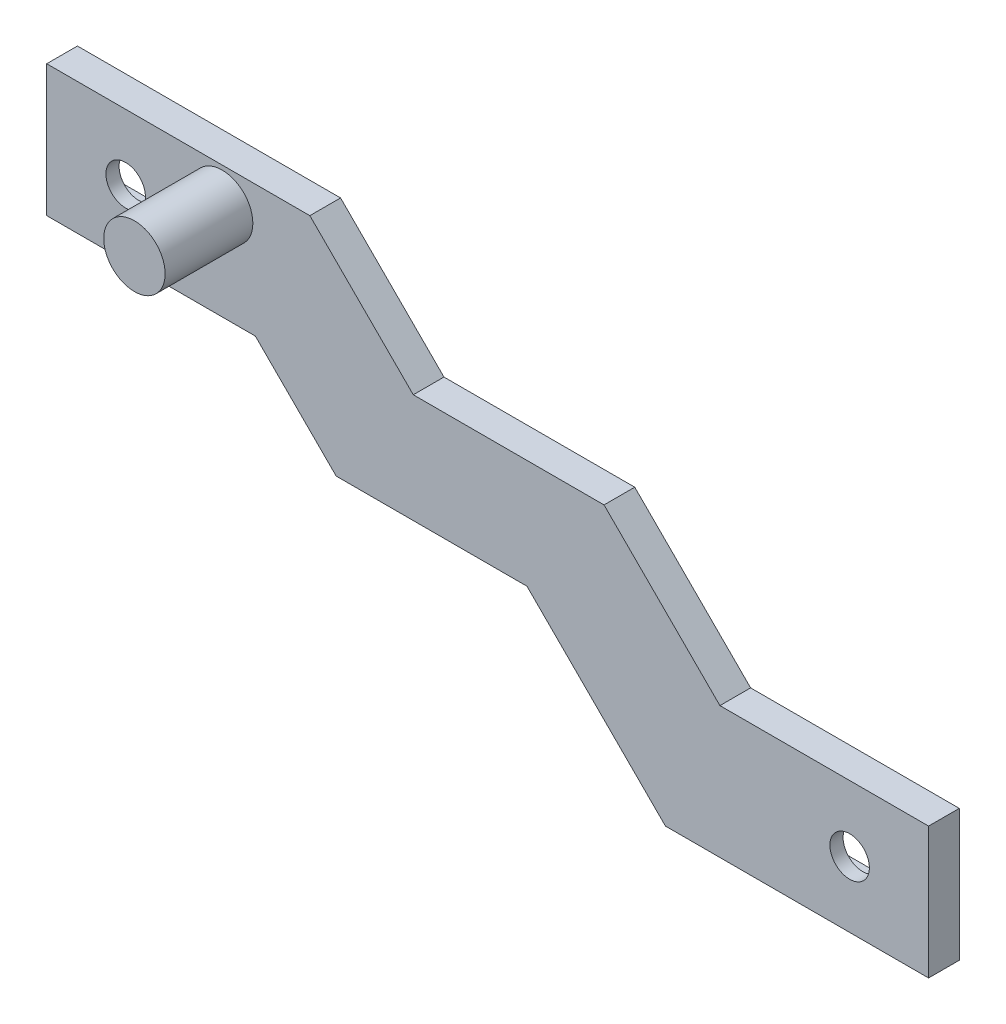
ISO-10303-21;
HEADER;
FILE_DESCRIPTION(('STEP AP214'),'2;1');
FILE_NAME('part.step','',(''),(''),'','','');
FILE_SCHEMA(('AUTOMOTIVE_DESIGN { 1 0 10303 214 1 1 1 1 }'));
ENDSEC;
DATA;
#1=APPLICATION_CONTEXT('core data for automotive mechanical design processes');
#2=APPLICATION_PROTOCOL_DEFINITION('international standard','automotive_design',2000,#1);
#3=PRODUCT_CONTEXT('',#1,'mechanical');
#4=PRODUCT('Part','Part','',(#3));
#5=PRODUCT_RELATED_PRODUCT_CATEGORY('part','',(#4));
#6=PRODUCT_DEFINITION_FORMATION('','',#4);
#7=PRODUCT_DEFINITION_CONTEXT('part definition',#1,'design');
#8=PRODUCT_DEFINITION('design','',#6,#7);
#9=PRODUCT_DEFINITION_SHAPE('','',#8);
#10=(LENGTH_UNIT() NAMED_UNIT(*) SI_UNIT(.MILLI.,.METRE.));
#11=(NAMED_UNIT(*) PLANE_ANGLE_UNIT() SI_UNIT($,.RADIAN.));
#12=(NAMED_UNIT(*) SI_UNIT($,.STERADIAN.) SOLID_ANGLE_UNIT());
#13=UNCERTAINTY_MEASURE_WITH_UNIT(LENGTH_MEASURE(1.E-05),#10,'distance_accuracy_value','');
#14=(GEOMETRIC_REPRESENTATION_CONTEXT(3) GLOBAL_UNCERTAINTY_ASSIGNED_CONTEXT((#13)) GLOBAL_UNIT_ASSIGNED_CONTEXT((#10,
#11,#12)) REPRESENTATION_CONTEXT('',''));
#15=CARTESIAN_POINT('',(0.,0.,0.));
#16=DIRECTION('',(0.,0.,1.));
#17=DIRECTION('',(1.,0.,0.));
#18=AXIS2_PLACEMENT_3D('',#15,#16,#17);
#19=CARTESIAN_POINT('',(0.,0.,0.));
#20=DIRECTION('',(0.,0.,1.));
#21=DIRECTION('',(1.,0.,0.));
#22=AXIS2_PLACEMENT_3D('',#19,#20,#21);
#23=PLANE('',#22);
#24=DIRECTION('',(0.,1.,0.));
#25=VECTOR('',#24,1.);
#26=CARTESIAN_POINT('',(32.7303847577293,21.5,0.));
#27=LINE('',#26,#25);
#28=CARTESIAN_POINT('',(32.7303847577293,21.5,0.));
#29=VERTEX_POINT('',#28);
#30=CARTESIAN_POINT('',(32.7303847577293,28.5,0.));
#31=VERTEX_POINT('',#30);
#32=EDGE_CURVE('E307',#29,#31,#27,.T.);
#33=ORIENTED_EDGE('',*,*,#32,.T.);
#34=DIRECTION('',(-1.,0.,0.));
#35=VECTOR('',#34,1.);
#36=CARTESIAN_POINT('',(32.7303847577293,28.5,0.));
#37=LINE('',#36,#35);
#38=CARTESIAN_POINT('',(15.7303847577293,28.5,0.));
#39=VERTEX_POINT('',#38);
#40=EDGE_CURVE('E324',#31,#39,#37,.T.);
#41=ORIENTED_EDGE('',*,*,#40,.T.);
#42=DIRECTION('',(0.,-1.,0.));
#43=VECTOR('',#42,1.);
#44=CARTESIAN_POINT('',(15.7303847577293,21.5,0.));
#45=LINE('',#44,#43);
#46=CARTESIAN_POINT('',(15.7303847577293,21.5,0.));
#47=VERTEX_POINT('',#46);
#48=EDGE_CURVE('E327',#39,#47,#45,.T.);
#49=ORIENTED_EDGE('',*,*,#48,.T.);
#50=DIRECTION('',(1.,0.,0.));
#51=VECTOR('',#50,1.);
#52=CARTESIAN_POINT('',(32.7303847577293,21.5,0.));
#53=LINE('',#52,#51);
#54=EDGE_CURVE('E312',#47,#29,#53,.T.);
#55=ORIENTED_EDGE('',*,*,#54,.T.);
#56=EDGE_LOOP('',(#33,#41,#49,#55));
#57=FACE_BOUND('',#56,.T.);
#58=DIRECTION('',(0.,1.,0.));
#59=VECTOR('',#58,1.);
#60=CARTESIAN_POINT('',(109.269615242271,-3.49999999999999,0.));
#61=LINE('',#60,#59);
#62=CARTESIAN_POINT('',(109.269615242271,-3.49999999999999,0.));
#63=VERTEX_POINT('',#62);
#64=CARTESIAN_POINT('',(109.269615242271,3.5,0.));
#65=VERTEX_POINT('',#64);
#66=EDGE_CURVE('E273',#63,#65,#61,.T.);
#67=ORIENTED_EDGE('',*,*,#66,.T.);
#68=DIRECTION('',(-1.,0.,0.));
#69=VECTOR('',#68,1.);
#70=CARTESIAN_POINT('',(109.269615242271,3.5,0.));
#71=LINE('',#70,#69);
#72=CARTESIAN_POINT('',(92.2696152422706,3.5,0.));
#73=VERTEX_POINT('',#72);
#74=EDGE_CURVE('E290',#65,#73,#71,.T.);
#75=ORIENTED_EDGE('',*,*,#74,.T.);
#76=DIRECTION('',(0.,-1.,0.));
#77=VECTOR('',#76,1.);
#78=CARTESIAN_POINT('',(92.2696152422706,-3.5,0.));
#79=LINE('',#78,#77);
#80=CARTESIAN_POINT('',(92.2696152422706,-3.5,0.));
#81=VERTEX_POINT('',#80);
#82=EDGE_CURVE('E293',#73,#81,#79,.T.);
#83=ORIENTED_EDGE('',*,*,#82,.T.);
#84=DIRECTION('',(1.,0.,0.));
#85=VECTOR('',#84,1.);
#86=CARTESIAN_POINT('',(109.269615242271,-3.49999999999999,0.));
#87=LINE('',#86,#85);
#88=EDGE_CURVE('E278',#81,#63,#87,.T.);
#89=ORIENTED_EDGE('',*,*,#88,.T.);
#90=EDGE_LOOP('',(#67,#75,#83,#89));
#91=FACE_BOUND('',#90,.T.);
#92=DIRECTION('',(-0.707106781186552,0.707106781186543,0.));
#93=VECTOR('',#92,1.);
#94=CARTESIAN_POINT('',(37.3651923788644,37.3651923788649,0.));
#95=LINE('',#94,#93);
#96=CARTESIAN_POINT('',(54.0203847577294,20.7100000000001,0.));
#97=VERTEX_POINT('',#96);
#98=CARTESIAN_POINT('',(42.2303847577293,32.5,0.));
#99=VERTEX_POINT('',#98);
#100=EDGE_CURVE('E250',#97,#99,#95,.T.);
#101=ORIENTED_EDGE('',*,*,#100,.F.);
#102=DIRECTION('',(-1.,0.,0.));
#103=VECTOR('',#102,1.);
#104=CARTESIAN_POINT('',(0.,20.7100000000001,0.));
#105=LINE('',#104,#103);
#106=CARTESIAN_POINT('',(75.7696152422707,20.7100000000001,0.));
#107=VERTEX_POINT('',#106);
#108=EDGE_CURVE('E248',#107,#97,#105,.T.);
#109=ORIENTED_EDGE('',*,*,#108,.F.);
#110=DIRECTION('',(-0.707106781186546,0.707106781186549,0.));
#111=VECTOR('',#110,1.);
#112=CARTESIAN_POINT('',(48.2398076211355,48.2398076211353,0.));
#113=LINE('',#112,#111);
#114=CARTESIAN_POINT('',(88.9796152422707,7.50000000000003,0.));
#115=VERTEX_POINT('',#114);
#116=EDGE_CURVE('E246',#115,#107,#113,.T.);
#117=ORIENTED_EDGE('',*,*,#116,.F.);
#118=DIRECTION('',(-1.,0.,0.));
#119=VECTOR('',#118,1.);
#120=CARTESIAN_POINT('',(0.,7.50000000000003,0.));
#121=LINE('',#120,#119);
#122=CARTESIAN_POINT('',(112.769615242271,7.50000000000003,0.));
#123=VERTEX_POINT('',#122);
#124=EDGE_CURVE('E244',#123,#115,#121,.T.);
#125=ORIENTED_EDGE('',*,*,#124,.F.);
#126=DIRECTION('',(0.,1.,0.));
#127=VECTOR('',#126,1.);
#128=CARTESIAN_POINT('',(112.769615242271,-7.49999999999999,0.));
#129=LINE('',#128,#127);
#130=CARTESIAN_POINT('',(112.769615242271,-7.49999999999999,0.));
#131=VERTEX_POINT('',#130);
#132=EDGE_CURVE('E341',#131,#123,#129,.T.);
#133=ORIENTED_EDGE('',*,*,#132,.F.);
#134=DIRECTION('',(1.,0.,0.));
#135=VECTOR('',#134,1.);
#136=CARTESIAN_POINT('',(112.769615242271,-7.49999999999999,0.));
#137=LINE('',#136,#135);
#138=CARTESIAN_POINT('',(82.7696152422706,-7.5,0.));
#139=VERTEX_POINT('',#138);
#140=EDGE_CURVE('E349',#139,#131,#137,.T.);
#141=ORIENTED_EDGE('',*,*,#140,.F.);
#142=DIRECTION('',(0.707106781186552,-0.707106781186543,0.));
#143=VECTOR('',#142,1.);
#144=CARTESIAN_POINT('',(37.6348076211348,37.6348076211353,0.));
#145=LINE('',#144,#143);
#146=CARTESIAN_POINT('',(66.9828186778667,8.28679656440374,0.));
#147=VERTEX_POINT('',#146);
#148=EDGE_CURVE('E242',#147,#139,#145,.T.);
#149=ORIENTED_EDGE('',*,*,#148,.F.);
#150=DIRECTION('',(1.,0.,0.));
#151=VECTOR('',#150,1.);
#152=CARTESIAN_POINT('',(0.,8.28679656440372,0.));
#153=LINE('',#152,#151);
#154=CARTESIAN_POINT('',(45.2303847577293,8.28679656440373,0.));
#155=VERTEX_POINT('',#154);
#156=EDGE_CURVE('E240',#155,#147,#153,.T.);
#157=ORIENTED_EDGE('',*,*,#156,.F.);
#158=DIRECTION('',(0.707106781186552,-0.707106781186543,0.));
#159=VECTOR('',#158,1.);
#160=CARTESIAN_POINT('',(26.7585906610663,26.7585906610666,0.));
#161=LINE('',#160,#159);
#162=CARTESIAN_POINT('',(36.0171813221329,17.5,0.));
#163=VERTEX_POINT('',#162);
#164=EDGE_CURVE('E184',#163,#155,#161,.T.);
#165=ORIENTED_EDGE('',*,*,#164,.F.);
#166=DIRECTION('',(1.,0.,0.));
#167=VECTOR('',#166,1.);
#168=CARTESIAN_POINT('',(0.,17.5,0.));
#169=LINE('',#168,#167);
#170=CARTESIAN_POINT('',(12.2303847577293,17.5,0.));
#171=VERTEX_POINT('',#170);
#172=EDGE_CURVE('E222',#171,#163,#169,.T.);
#173=ORIENTED_EDGE('',*,*,#172,.F.);
#174=DIRECTION('',(0.,-1.,0.));
#175=VECTOR('',#174,1.);
#176=CARTESIAN_POINT('',(12.2303847577293,-7.50000000000001,0.));
#177=LINE('',#176,#175);
#178=CARTESIAN_POINT('',(12.2303847577293,32.5,0.));
#179=VERTEX_POINT('',#178);
#180=EDGE_CURVE('E346',#179,#171,#177,.T.);
#181=ORIENTED_EDGE('',*,*,#180,.F.);
#182=DIRECTION('',(-1.,0.,0.));
#183=VECTOR('',#182,1.);
#184=CARTESIAN_POINT('',(112.769615242271,32.5,0.));
#185=LINE('',#184,#183);
#186=EDGE_CURVE('E344',#99,#179,#185,.T.);
#187=ORIENTED_EDGE('',*,*,#186,.F.);
#188=EDGE_LOOP('',(#101,#109,#117,#125,#133,#141,#149,#157,#165,#173,#181,#187));
#189=FACE_BOUND('',#188,.T.);
#190=ADVANCED_FACE('F43',(#57,#91,#189),#23,.F.);
#191=CARTESIAN_POINT('',(112.769615242271,-7.49999999999999,2.));
#192=DIRECTION('',(-1.,0.,0.));
#193=DIRECTION('',(0.,0.,1.));
#194=AXIS2_PLACEMENT_3D('',#191,#192,#193);
#195=PLANE('',#194);
#196=DIRECTION('',(0.,0.,1.));
#197=VECTOR('',#196,1.);
#198=CARTESIAN_POINT('',(112.769615242271,7.50000000000003,-28.));
#199=LINE('',#198,#197);
#200=CARTESIAN_POINT('',(112.769615242271,7.50000000000003,3.5));
#201=VERTEX_POINT('',#200);
#202=EDGE_CURVE('E229',#123,#201,#199,.T.);
#203=ORIENTED_EDGE('',*,*,#202,.T.);
#204=DIRECTION('',(0.,1.,0.));
#205=VECTOR('',#204,1.);
#206=CARTESIAN_POINT('',(112.769615242271,32.5,3.5));
#207=LINE('',#206,#205);
#208=CARTESIAN_POINT('',(112.769615242271,-7.49999999999999,3.5));
#209=VERTEX_POINT('',#208);
#210=EDGE_CURVE('E268',#209,#201,#207,.T.);
#211=ORIENTED_EDGE('',*,*,#210,.F.);
#212=DIRECTION('',(0.,0.,-1.));
#213=VECTOR('',#212,1.);
#214=CARTESIAN_POINT('',(112.769615242271,-7.49999999999999,2.));
#215=LINE('',#214,#213);
#216=EDGE_CURVE('E51',#209,#131,#215,.T.);
#217=ORIENTED_EDGE('',*,*,#216,.T.);
#218=ORIENTED_EDGE('',*,*,#132,.T.);
#219=EDGE_LOOP('',(#203,#211,#217,#218));
#220=FACE_BOUND('',#219,.T.);
#221=ADVANCED_FACE('F45',(#220),#195,.F.);
#222=CARTESIAN_POINT('',(112.769615242271,32.5,2.));
#223=DIRECTION('',(0.,-1.,0.));
#224=DIRECTION('',(1.,0.,0.));
#225=AXIS2_PLACEMENT_3D('',#222,#223,#224);
#226=PLANE('',#225);
#227=DIRECTION('',(0.,0.,1.));
#228=VECTOR('',#227,1.);
#229=CARTESIAN_POINT('',(42.2303847577293,32.5,-28.));
#230=LINE('',#229,#228);
#231=CARTESIAN_POINT('',(42.2303847577293,32.5,3.5));
#232=VERTEX_POINT('',#231);
#233=EDGE_CURVE('E220',#99,#232,#230,.T.);
#234=ORIENTED_EDGE('',*,*,#233,.F.);
#235=ORIENTED_EDGE('',*,*,#186,.T.);
#236=DIRECTION('',(0.,0.,-1.));
#237=VECTOR('',#236,1.);
#238=CARTESIAN_POINT('',(12.2303847577293,32.5,2.));
#239=LINE('',#238,#237);
#240=CARTESIAN_POINT('',(12.2303847577293,32.5,3.5));
#241=VERTEX_POINT('',#240);
#242=EDGE_CURVE('E11',#241,#179,#239,.T.);
#243=ORIENTED_EDGE('',*,*,#242,.F.);
#244=DIRECTION('',(-1.,0.,0.));
#245=VECTOR('',#244,1.);
#246=CARTESIAN_POINT('',(12.2303847577293,32.5,3.5));
#247=LINE('',#246,#245);
#248=EDGE_CURVE('E271',#232,#241,#247,.T.);
#249=ORIENTED_EDGE('',*,*,#248,.F.);
#250=EDGE_LOOP('',(#234,#235,#243,#249));
#251=FACE_BOUND('',#250,.T.);
#252=ADVANCED_FACE('F380',(#251),#226,.F.);
#253=CARTESIAN_POINT('',(12.2303847577293,-7.50000000000001,2.));
#254=DIRECTION('',(1.,0.,0.));
#255=DIRECTION('',(0.,0.,-1.));
#256=AXIS2_PLACEMENT_3D('',#253,#254,#255);
#257=PLANE('',#256);
#258=DIRECTION('',(0.,0.,1.));
#259=VECTOR('',#258,1.);
#260=CARTESIAN_POINT('',(12.2303847577293,17.5,-28.));
#261=LINE('',#260,#259);
#262=CARTESIAN_POINT('',(12.2303847577293,17.5,3.5));
#263=VERTEX_POINT('',#262);
#264=EDGE_CURVE('E219',#171,#263,#261,.T.);
#265=ORIENTED_EDGE('',*,*,#264,.T.);
#266=DIRECTION('',(0.,-1.,0.));
#267=VECTOR('',#266,1.);
#268=CARTESIAN_POINT('',(12.2303847577293,32.5,3.5));
#269=LINE('',#268,#267);
#270=EDGE_CURVE('E262',#241,#263,#269,.T.);
#271=ORIENTED_EDGE('',*,*,#270,.F.);
#272=ORIENTED_EDGE('',*,*,#242,.T.);
#273=ORIENTED_EDGE('',*,*,#180,.T.);
#274=EDGE_LOOP('',(#265,#271,#272,#273));
#275=FACE_BOUND('',#274,.T.);
#276=ADVANCED_FACE('F390',(#275),#257,.F.);
#277=CARTESIAN_POINT('',(112.769615242271,-7.49999999999999,2.));
#278=DIRECTION('',(0.,1.,0.));
#279=DIRECTION('',(-1.,0.,0.));
#280=AXIS2_PLACEMENT_3D('',#277,#278,#279);
#281=PLANE('',#280);
#282=DIRECTION('',(0.,0.,1.));
#283=VECTOR('',#282,1.);
#284=CARTESIAN_POINT('',(82.7696152422706,-7.5,-28.));
#285=LINE('',#284,#283);
#286=CARTESIAN_POINT('',(82.7696152422706,-7.5,3.5));
#287=VERTEX_POINT('',#286);
#288=EDGE_CURVE('E232',#139,#287,#285,.T.);
#289=ORIENTED_EDGE('',*,*,#288,.F.);
#290=ORIENTED_EDGE('',*,*,#140,.T.);
#291=ORIENTED_EDGE('',*,*,#216,.F.);
#292=DIRECTION('',(1.,0.,0.));
#293=VECTOR('',#292,1.);
#294=CARTESIAN_POINT('',(12.2303847577293,-7.49999999999999,3.5));
#295=LINE('',#294,#293);
#296=EDGE_CURVE('E266',#287,#209,#295,.T.);
#297=ORIENTED_EDGE('',*,*,#296,.F.);
#298=EDGE_LOOP('',(#289,#290,#291,#297));
#299=FACE_BOUND('',#298,.T.);
#300=ADVANCED_FACE('F384',(#299),#281,.F.);
#301=CARTESIAN_POINT('',(0.,0.,3.5));
#302=DIRECTION('',(0.,0.,1.));
#303=DIRECTION('',(1.,0.,0.));
#304=AXIS2_PLACEMENT_3D('',#301,#302,#303);
#305=PLANE('',#304);
#306=CARTESIAN_POINT('',(32.2303847577293,28.5,3.5));
#307=DIRECTION('',(0.,0.,1.));
#308=DIRECTION('',(1.,0.,0.));
#309=AXIS2_PLACEMENT_3D('',#306,#307,#308);
#310=CIRCLE('',#309,3.5);
#311=CARTESIAN_POINT('',(35.7303847577293,28.5,3.5));
#312=VERTEX_POINT('',#311);
#313=EDGE_CURVE('E680',#312,#312,#310,.T.);
#314=ORIENTED_EDGE('',*,*,#313,.F.);
#315=EDGE_LOOP('',(#314));
#316=FACE_BOUND('',#315,.T.);
#317=CARTESIAN_POINT('',(21.2303847577281,25.,3.5));
#318=DIRECTION('',(0.,0.,1.));
#319=DIRECTION('',(1.,0.,0.));
#320=AXIS2_PLACEMENT_3D('',#317,#318,#319);
#321=CIRCLE('',#320,2.25);
#322=CARTESIAN_POINT('',(23.4803847577281,25.,3.5));
#323=VERTEX_POINT('',#322);
#324=EDGE_CURVE('E259',#323,#323,#321,.T.);
#325=ORIENTED_EDGE('',*,*,#324,.F.);
#326=EDGE_LOOP('',(#325));
#327=FACE_BOUND('',#326,.T.);
#328=CARTESIAN_POINT('',(103.769615242269,3.67761376907083E-13,3.5));
#329=DIRECTION('',(0.,0.,1.));
#330=DIRECTION('',(1.,0.,0.));
#331=AXIS2_PLACEMENT_3D('',#328,#329,#330);
#332=CIRCLE('',#331,2.25);
#333=CARTESIAN_POINT('',(106.019615242269,3.67761376907083E-13,3.5));
#334=VERTEX_POINT('',#333);
#335=EDGE_CURVE('E253',#334,#334,#332,.T.);
#336=ORIENTED_EDGE('',*,*,#335,.F.);
#337=EDGE_LOOP('',(#336));
#338=FACE_BOUND('',#337,.T.);
#339=DIRECTION('',(-1.,0.,0.));
#340=VECTOR('',#339,1.);
#341=CARTESIAN_POINT('',(54.0203847577294,20.7100000000001,3.5));
#342=LINE('',#341,#340);
#343=CARTESIAN_POINT('',(75.7696152422707,20.7100000000001,3.5));
#344=VERTEX_POINT('',#343);
#345=CARTESIAN_POINT('',(54.0203847577294,20.7100000000001,3.5));
#346=VERTEX_POINT('',#345);
#347=EDGE_CURVE('E214',#344,#346,#342,.T.);
#348=ORIENTED_EDGE('',*,*,#347,.T.);
#349=DIRECTION('',(-0.707106781186552,0.707106781186543,0.));
#350=VECTOR('',#349,1.);
#351=CARTESIAN_POINT('',(42.2303847577293,32.5,3.5));
#352=LINE('',#351,#350);
#353=EDGE_CURVE('E216',#346,#232,#352,.T.);
#354=ORIENTED_EDGE('',*,*,#353,.T.);
#355=ORIENTED_EDGE('',*,*,#248,.T.);
#356=ORIENTED_EDGE('',*,*,#270,.T.);
#357=DIRECTION('',(1.,0.,0.));
#358=VECTOR('',#357,1.);
#359=CARTESIAN_POINT('',(36.0171813221329,17.5,3.5));
#360=LINE('',#359,#358);
#361=CARTESIAN_POINT('',(36.0171813221329,17.5,3.5));
#362=VERTEX_POINT('',#361);
#363=EDGE_CURVE('E203',#263,#362,#360,.T.);
#364=ORIENTED_EDGE('',*,*,#363,.T.);
#365=DIRECTION('',(0.707106781186552,-0.707106781186543,0.));
#366=VECTOR('',#365,1.);
#367=CARTESIAN_POINT('',(45.2303847577293,8.28679656440373,3.5));
#368=LINE('',#367,#366);
#369=CARTESIAN_POINT('',(45.2303847577293,8.28679656440373,3.5));
#370=VERTEX_POINT('',#369);
#371=EDGE_CURVE('E66',#362,#370,#368,.T.);
#372=ORIENTED_EDGE('',*,*,#371,.T.);
#373=DIRECTION('',(1.,0.,0.));
#374=VECTOR('',#373,1.);
#375=CARTESIAN_POINT('',(66.9828186778667,8.28679656440374,3.5));
#376=LINE('',#375,#374);
#377=CARTESIAN_POINT('',(66.9828186778667,8.28679656440374,3.5));
#378=VERTEX_POINT('',#377);
#379=EDGE_CURVE('E191',#370,#378,#376,.T.);
#380=ORIENTED_EDGE('',*,*,#379,.T.);
#381=DIRECTION('',(0.707106781186552,-0.707106781186543,0.));
#382=VECTOR('',#381,1.);
#383=CARTESIAN_POINT('',(82.7696152422706,-7.5,3.5));
#384=LINE('',#383,#382);
#385=EDGE_CURVE('E197',#378,#287,#384,.T.);
#386=ORIENTED_EDGE('',*,*,#385,.T.);
#387=ORIENTED_EDGE('',*,*,#296,.T.);
#388=ORIENTED_EDGE('',*,*,#210,.T.);
#389=DIRECTION('',(-1.,0.,0.));
#390=VECTOR('',#389,1.);
#391=CARTESIAN_POINT('',(88.9796152422707,7.50000000000003,3.5));
#392=LINE('',#391,#390);
#393=CARTESIAN_POINT('',(88.9796152422707,7.50000000000003,3.5));
#394=VERTEX_POINT('',#393);
#395=EDGE_CURVE('E210',#201,#394,#392,.T.);
#396=ORIENTED_EDGE('',*,*,#395,.T.);
#397=DIRECTION('',(-0.707106781186546,0.707106781186549,0.));
#398=VECTOR('',#397,1.);
#399=CARTESIAN_POINT('',(75.7696152422707,20.7100000000001,3.5));
#400=LINE('',#399,#398);
#401=EDGE_CURVE('E58',#394,#344,#400,.T.);
#402=ORIENTED_EDGE('',*,*,#401,.T.);
#403=EDGE_LOOP('',(#348,#354,#355,#356,#364,#372,#380,#386,#387,#388,#396,#402));
#404=FACE_BOUND('',#403,.T.);
#405=ADVANCED_FACE('F201',(#316,#327,#338,#404),#305,.T.);
#406=CARTESIAN_POINT('',(32.7303847577293,21.5,2.));
#407=DIRECTION('',(-1.,0.,0.));
#408=DIRECTION('',(0.,0.,1.));
#409=AXIS2_PLACEMENT_3D('',#406,#407,#408);
#410=PLANE('',#409);
#411=ORIENTED_EDGE('',*,*,#32,.F.);
#412=DIRECTION('',(0.,0.,-1.));
#413=VECTOR('',#412,1.);
#414=CARTESIAN_POINT('',(32.7303847577293,21.5,2.));
#415=LINE('',#414,#413);
#416=CARTESIAN_POINT('',(32.7303847577293,21.5,2.));
#417=VERTEX_POINT('',#416);
#418=EDGE_CURVE('E321',#417,#29,#415,.T.);
#419=ORIENTED_EDGE('',*,*,#418,.F.);
#420=DIRECTION('',(0.,1.,0.));
#421=VECTOR('',#420,1.);
#422=CARTESIAN_POINT('',(32.7303847577293,21.5,2.));
#423=LINE('',#422,#421);
#424=CARTESIAN_POINT('',(32.7303847577293,28.5,2.));
#425=VERTEX_POINT('',#424);
#426=EDGE_CURVE('E308',#417,#425,#423,.T.);
#427=ORIENTED_EDGE('',*,*,#426,.T.);
#428=DIRECTION('',(0.,0.,-1.));
#429=VECTOR('',#428,1.);
#430=CARTESIAN_POINT('',(32.7303847577293,28.5,2.));
#431=LINE('',#430,#429);
#432=EDGE_CURVE('E338',#425,#31,#431,.T.);
#433=ORIENTED_EDGE('',*,*,#432,.T.);
#434=EDGE_LOOP('',(#411,#419,#427,#433));
#435=FACE_BOUND('',#434,.T.);
#436=ADVANCED_FACE('F413',(#435),#410,.T.);
#437=CARTESIAN_POINT('',(32.7303847577293,28.5,2.));
#438=DIRECTION('',(0.,-1.,0.));
#439=DIRECTION('',(0.,0.,-1.));
#440=AXIS2_PLACEMENT_3D('',#437,#438,#439);
#441=PLANE('',#440);
#442=ORIENTED_EDGE('',*,*,#40,.F.);
#443=ORIENTED_EDGE('',*,*,#432,.F.);
#444=DIRECTION('',(-1.,0.,0.));
#445=VECTOR('',#444,1.);
#446=CARTESIAN_POINT('',(32.7303847577293,28.5,2.));
#447=LINE('',#446,#445);
#448=CARTESIAN_POINT('',(15.7303847577293,28.5,2.));
#449=VERTEX_POINT('',#448);
#450=EDGE_CURVE('E311',#425,#449,#447,.T.);
#451=ORIENTED_EDGE('',*,*,#450,.T.);
#452=DIRECTION('',(0.,0.,-1.));
#453=VECTOR('',#452,1.);
#454=CARTESIAN_POINT('',(15.7303847577293,28.5,2.));
#455=LINE('',#454,#453);
#456=EDGE_CURVE('E336',#449,#39,#455,.T.);
#457=ORIENTED_EDGE('',*,*,#456,.T.);
#458=EDGE_LOOP('',(#442,#443,#451,#457));
#459=FACE_BOUND('',#458,.T.);
#460=ADVANCED_FACE('F525',(#459),#441,.T.);
#461=CARTESIAN_POINT('',(15.7303847577293,21.5,2.));
#462=DIRECTION('',(1.,0.,0.));
#463=DIRECTION('',(0.,0.,-1.));
#464=AXIS2_PLACEMENT_3D('',#461,#462,#463);
#465=PLANE('',#464);
#466=ORIENTED_EDGE('',*,*,#48,.F.);
#467=ORIENTED_EDGE('',*,*,#456,.F.);
#468=DIRECTION('',(0.,-1.,0.));
#469=VECTOR('',#468,1.);
#470=CARTESIAN_POINT('',(15.7303847577293,21.5,2.));
#471=LINE('',#470,#469);
#472=CARTESIAN_POINT('',(15.7303847577293,21.5,2.));
#473=VERTEX_POINT('',#472);
#474=EDGE_CURVE('E315',#449,#473,#471,.T.);
#475=ORIENTED_EDGE('',*,*,#474,.T.);
#476=DIRECTION('',(0.,0.,-1.));
#477=VECTOR('',#476,1.);
#478=CARTESIAN_POINT('',(15.7303847577293,21.5,2.));
#479=LINE('',#478,#477);
#480=EDGE_CURVE('E334',#473,#47,#479,.T.);
#481=ORIENTED_EDGE('',*,*,#480,.T.);
#482=EDGE_LOOP('',(#466,#467,#475,#481));
#483=FACE_BOUND('',#482,.T.);
#484=ADVANCED_FACE('F516',(#483),#465,.T.);
#485=CARTESIAN_POINT('',(32.7303847577293,21.5,2.));
#486=DIRECTION('',(0.,1.,0.));
#487=DIRECTION('',(-1.,0.,0.));
#488=AXIS2_PLACEMENT_3D('',#485,#486,#487);
#489=PLANE('',#488);
#490=ORIENTED_EDGE('',*,*,#54,.F.);
#491=ORIENTED_EDGE('',*,*,#480,.F.);
#492=DIRECTION('',(1.,0.,0.));
#493=VECTOR('',#492,1.);
#494=CARTESIAN_POINT('',(32.7303847577293,21.5,2.));
#495=LINE('',#494,#493);
#496=EDGE_CURVE('E318',#473,#417,#495,.T.);
#497=ORIENTED_EDGE('',*,*,#496,.T.);
#498=ORIENTED_EDGE('',*,*,#418,.T.);
#499=EDGE_LOOP('',(#490,#491,#497,#498));
#500=FACE_BOUND('',#499,.T.);
#501=ADVANCED_FACE('F507',(#500),#489,.T.);
#502=CARTESIAN_POINT('',(109.269615242271,-3.49999999999999,2.));
#503=DIRECTION('',(-1.,0.,0.));
#504=DIRECTION('',(0.,0.,1.));
#505=AXIS2_PLACEMENT_3D('',#502,#503,#504);
#506=PLANE('',#505);
#507=ORIENTED_EDGE('',*,*,#66,.F.);
#508=DIRECTION('',(0.,0.,-1.));
#509=VECTOR('',#508,1.);
#510=CARTESIAN_POINT('',(109.269615242271,-3.49999999999999,2.));
#511=LINE('',#510,#509);
#512=CARTESIAN_POINT('',(109.269615242271,-3.49999999999999,2.));
#513=VERTEX_POINT('',#512);
#514=EDGE_CURVE('E287',#513,#63,#511,.T.);
#515=ORIENTED_EDGE('',*,*,#514,.F.);
#516=DIRECTION('',(0.,1.,0.));
#517=VECTOR('',#516,1.);
#518=CARTESIAN_POINT('',(109.269615242271,-3.49999999999999,2.));
#519=LINE('',#518,#517);
#520=CARTESIAN_POINT('',(109.269615242271,3.5,2.));
#521=VERTEX_POINT('',#520);
#522=EDGE_CURVE('E274',#513,#521,#519,.T.);
#523=ORIENTED_EDGE('',*,*,#522,.T.);
#524=DIRECTION('',(0.,0.,-1.));
#525=VECTOR('',#524,1.);
#526=CARTESIAN_POINT('',(109.269615242271,3.5,2.));
#527=LINE('',#526,#525);
#528=EDGE_CURVE('E304',#521,#65,#527,.T.);
#529=ORIENTED_EDGE('',*,*,#528,.T.);
#530=EDGE_LOOP('',(#507,#515,#523,#529));
#531=FACE_BOUND('',#530,.T.);
#532=ADVANCED_FACE('F498',(#531),#506,.T.);
#533=CARTESIAN_POINT('',(109.269615242271,3.5,2.));
#534=DIRECTION('',(0.,-1.,0.));
#535=DIRECTION('',(0.,0.,-1.));
#536=AXIS2_PLACEMENT_3D('',#533,#534,#535);
#537=PLANE('',#536);
#538=ORIENTED_EDGE('',*,*,#74,.F.);
#539=ORIENTED_EDGE('',*,*,#528,.F.);
#540=DIRECTION('',(-1.,0.,0.));
#541=VECTOR('',#540,1.);
#542=CARTESIAN_POINT('',(109.269615242271,3.5,2.));
#543=LINE('',#542,#541);
#544=CARTESIAN_POINT('',(92.2696152422706,3.5,2.));
#545=VERTEX_POINT('',#544);
#546=EDGE_CURVE('E277',#521,#545,#543,.T.);
#547=ORIENTED_EDGE('',*,*,#546,.T.);
#548=DIRECTION('',(0.,0.,-1.));
#549=VECTOR('',#548,1.);
#550=CARTESIAN_POINT('',(92.2696152422706,3.5,2.));
#551=LINE('',#550,#549);
#552=EDGE_CURVE('E302',#545,#73,#551,.T.);
#553=ORIENTED_EDGE('',*,*,#552,.T.);
#554=EDGE_LOOP('',(#538,#539,#547,#553));
#555=FACE_BOUND('',#554,.T.);
#556=ADVANCED_FACE('F489',(#555),#537,.T.);
#557=CARTESIAN_POINT('',(92.2696152422706,-3.5,2.));
#558=DIRECTION('',(1.,0.,0.));
#559=DIRECTION('',(0.,0.,-1.));
#560=AXIS2_PLACEMENT_3D('',#557,#558,#559);
#561=PLANE('',#560);
#562=ORIENTED_EDGE('',*,*,#82,.F.);
#563=ORIENTED_EDGE('',*,*,#552,.F.);
#564=DIRECTION('',(0.,-1.,0.));
#565=VECTOR('',#564,1.);
#566=CARTESIAN_POINT('',(92.2696152422706,-3.5,2.));
#567=LINE('',#566,#565);
#568=CARTESIAN_POINT('',(92.2696152422706,-3.5,2.));
#569=VERTEX_POINT('',#568);
#570=EDGE_CURVE('E281',#545,#569,#567,.T.);
#571=ORIENTED_EDGE('',*,*,#570,.T.);
#572=DIRECTION('',(0.,0.,-1.));
#573=VECTOR('',#572,1.);
#574=CARTESIAN_POINT('',(92.2696152422706,-3.5,2.));
#575=LINE('',#574,#573);
#576=EDGE_CURVE('E300',#569,#81,#575,.T.);
#577=ORIENTED_EDGE('',*,*,#576,.T.);
#578=EDGE_LOOP('',(#562,#563,#571,#577));
#579=FACE_BOUND('',#578,.T.);
#580=ADVANCED_FACE('F480',(#579),#561,.T.);
#581=CARTESIAN_POINT('',(109.269615242271,-3.49999999999999,2.));
#582=DIRECTION('',(0.,1.,0.));
#583=DIRECTION('',(-1.,0.,0.));
#584=AXIS2_PLACEMENT_3D('',#581,#582,#583);
#585=PLANE('',#584);
#586=ORIENTED_EDGE('',*,*,#88,.F.);
#587=ORIENTED_EDGE('',*,*,#576,.F.);
#588=DIRECTION('',(1.,0.,0.));
#589=VECTOR('',#588,1.);
#590=CARTESIAN_POINT('',(109.269615242271,-3.49999999999999,2.));
#591=LINE('',#590,#589);
#592=EDGE_CURVE('E284',#569,#513,#591,.T.);
#593=ORIENTED_EDGE('',*,*,#592,.T.);
#594=ORIENTED_EDGE('',*,*,#514,.T.);
#595=EDGE_LOOP('',(#586,#587,#593,#594));
#596=FACE_BOUND('',#595,.T.);
#597=ADVANCED_FACE('F472',(#596),#585,.T.);
#598=CARTESIAN_POINT('',(0.,0.,2.));
#599=DIRECTION('',(0.,0.,1.));
#600=DIRECTION('',(1.,0.,0.));
#601=AXIS2_PLACEMENT_3D('',#598,#599,#600);
#602=PLANE('',#601);
#603=ORIENTED_EDGE('',*,*,#450,.F.);
#604=ORIENTED_EDGE('',*,*,#426,.F.);
#605=ORIENTED_EDGE('',*,*,#496,.F.);
#606=ORIENTED_EDGE('',*,*,#474,.F.);
#607=EDGE_LOOP('',(#603,#604,#605,#606));
#608=FACE_BOUND('',#607,.T.);
#609=CARTESIAN_POINT('',(21.2303847577281,25.,2.));
#610=DIRECTION('',(0.,0.,1.));
#611=DIRECTION('',(1.,0.,0.));
#612=AXIS2_PLACEMENT_3D('',#609,#610,#611);
#613=CIRCLE('',#612,2.25);
#614=CARTESIAN_POINT('',(23.4803847577281,25.,2.));
#615=VERTEX_POINT('',#614);
#616=EDGE_CURVE('E256',#615,#615,#613,.T.);
#617=ORIENTED_EDGE('',*,*,#616,.T.);
#618=EDGE_LOOP('',(#617));
#619=FACE_BOUND('',#618,.T.);
#620=ADVANCED_FACE('F463',(#608,#619),#602,.F.);
#621=ORIENTED_EDGE('',*,*,#546,.F.);
#622=ORIENTED_EDGE('',*,*,#522,.F.);
#623=ORIENTED_EDGE('',*,*,#592,.F.);
#624=ORIENTED_EDGE('',*,*,#570,.F.);
#625=EDGE_LOOP('',(#621,#622,#623,#624));
#626=FACE_BOUND('',#625,.T.);
#627=CARTESIAN_POINT('',(103.769615242269,3.67761376907083E-13,2.));
#628=DIRECTION('',(0.,0.,1.));
#629=DIRECTION('',(1.,0.,0.));
#630=AXIS2_PLACEMENT_3D('',#627,#628,#629);
#631=CIRCLE('',#630,2.25);
#632=CARTESIAN_POINT('',(106.019615242269,3.67761376907083E-13,2.));
#633=VERTEX_POINT('',#632);
#634=EDGE_CURVE('E252',#633,#633,#631,.T.);
#635=ORIENTED_EDGE('',*,*,#634,.T.);
#636=EDGE_LOOP('',(#635));
#637=FACE_BOUND('',#636,.T.);
#638=ADVANCED_FACE('F454',(#626,#637),#602,.F.);
#639=CARTESIAN_POINT('',(21.2303847577281,25.,3.5));
#640=DIRECTION('',(0.,0.,-1.));
#641=DIRECTION('',(-1.,0.,0.));
#642=AXIS2_PLACEMENT_3D('',#639,#640,#641);
#643=CYLINDRICAL_SURFACE('',#642,2.25);
#644=ORIENTED_EDGE('',*,*,#324,.T.);
#645=EDGE_LOOP('',(#644));
#646=FACE_BOUND('',#645,.T.);
#647=ORIENTED_EDGE('',*,*,#616,.F.);
#648=EDGE_LOOP('',(#647));
#649=FACE_BOUND('',#648,.T.);
#650=ADVANCED_FACE('F401',(#646,#649),#643,.F.);
#651=CARTESIAN_POINT('',(103.769615242269,3.67761376907083E-13,3.5));
#652=DIRECTION('',(0.,0.,-1.));
#653=DIRECTION('',(-1.,0.,0.));
#654=AXIS2_PLACEMENT_3D('',#651,#652,#653);
#655=CYLINDRICAL_SURFACE('',#654,2.25);
#656=ORIENTED_EDGE('',*,*,#335,.T.);
#657=EDGE_LOOP('',(#656));
#658=FACE_BOUND('',#657,.T.);
#659=ORIENTED_EDGE('',*,*,#634,.F.);
#660=EDGE_LOOP('',(#659));
#661=FACE_BOUND('',#660,.T.);
#662=ADVANCED_FACE('F393',(#658,#661),#655,.F.);
#663=CARTESIAN_POINT('',(36.0171813221329,17.5,-28.));
#664=DIRECTION('',(0.,-1.,0.));
#665=DIRECTION('',(1.,0.,0.));
#666=AXIS2_PLACEMENT_3D('',#663,#664,#665);
#667=PLANE('',#666);
#668=ORIENTED_EDGE('',*,*,#172,.T.);
#669=DIRECTION('',(0.,0.,1.));
#670=VECTOR('',#669,1.);
#671=CARTESIAN_POINT('',(36.0171813221329,17.5,-28.));
#672=LINE('',#671,#670);
#673=EDGE_CURVE('E188',#163,#362,#672,.T.);
#674=ORIENTED_EDGE('',*,*,#673,.T.);
#675=ORIENTED_EDGE('',*,*,#363,.F.);
#676=ORIENTED_EDGE('',*,*,#264,.F.);
#677=EDGE_LOOP('',(#668,#674,#675,#676));
#678=FACE_BOUND('',#677,.T.);
#679=ADVANCED_FACE('F391',(#678),#667,.T.);
#680=CARTESIAN_POINT('',(45.2303847577293,8.28679656440373,-28.));
#681=DIRECTION('',(-0.707106781186543,-0.707106781186552,0.));
#682=DIRECTION('',(0.707106781186552,-0.707106781186543,0.));
#683=AXIS2_PLACEMENT_3D('',#680,#681,#682);
#684=PLANE('',#683);
#685=ORIENTED_EDGE('',*,*,#164,.T.);
#686=DIRECTION('',(0.,0.,1.));
#687=VECTOR('',#686,1.);
#688=CARTESIAN_POINT('',(45.2303847577293,8.28679656440373,-28.));
#689=LINE('',#688,#687);
#690=EDGE_CURVE('E180',#155,#370,#689,.T.);
#691=ORIENTED_EDGE('',*,*,#690,.T.);
#692=ORIENTED_EDGE('',*,*,#371,.F.);
#693=ORIENTED_EDGE('',*,*,#673,.F.);
#694=EDGE_LOOP('',(#685,#691,#692,#693));
#695=FACE_BOUND('',#694,.T.);
#696=ADVANCED_FACE('F182',(#695),#684,.T.);
#697=CARTESIAN_POINT('',(66.9828186778667,8.28679656440374,-28.));
#698=DIRECTION('',(0.,-1.,0.));
#699=DIRECTION('',(1.,0.,0.));
#700=AXIS2_PLACEMENT_3D('',#697,#698,#699);
#701=PLANE('',#700);
#702=ORIENTED_EDGE('',*,*,#156,.T.);
#703=DIRECTION('',(0.,0.,1.));
#704=VECTOR('',#703,1.);
#705=CARTESIAN_POINT('',(66.9828186778667,8.28679656440374,-28.));
#706=LINE('',#705,#704);
#707=EDGE_CURVE('E187',#147,#378,#706,.T.);
#708=ORIENTED_EDGE('',*,*,#707,.T.);
#709=ORIENTED_EDGE('',*,*,#379,.F.);
#710=ORIENTED_EDGE('',*,*,#690,.F.);
#711=EDGE_LOOP('',(#702,#708,#709,#710));
#712=FACE_BOUND('',#711,.T.);
#713=ADVANCED_FACE('F192',(#712),#701,.T.);
#714=CARTESIAN_POINT('',(82.7696152422706,-7.5,-28.));
#715=DIRECTION('',(-0.707106781186543,-0.707106781186552,0.));
#716=DIRECTION('',(0.707106781186552,-0.707106781186543,0.));
#717=AXIS2_PLACEMENT_3D('',#714,#715,#716);
#718=PLANE('',#717);
#719=ORIENTED_EDGE('',*,*,#148,.T.);
#720=ORIENTED_EDGE('',*,*,#288,.T.);
#721=ORIENTED_EDGE('',*,*,#385,.F.);
#722=ORIENTED_EDGE('',*,*,#707,.F.);
#723=EDGE_LOOP('',(#719,#720,#721,#722));
#724=FACE_BOUND('',#723,.T.);
#725=ADVANCED_FACE('F386',(#724),#718,.T.);
#726=CARTESIAN_POINT('',(42.2303847577293,32.5,-28.));
#727=DIRECTION('',(0.707106781186543,0.707106781186552,0.));
#728=DIRECTION('',(-0.707106781186552,0.707106781186543,0.));
#729=AXIS2_PLACEMENT_3D('',#726,#727,#728);
#730=PLANE('',#729);
#731=ORIENTED_EDGE('',*,*,#100,.T.);
#732=ORIENTED_EDGE('',*,*,#233,.T.);
#733=ORIENTED_EDGE('',*,*,#353,.F.);
#734=DIRECTION('',(0.,0.,1.));
#735=VECTOR('',#734,1.);
#736=CARTESIAN_POINT('',(54.0203847577294,20.7100000000001,-28.));
#737=LINE('',#736,#735);
#738=EDGE_CURVE('E223',#97,#346,#737,.T.);
#739=ORIENTED_EDGE('',*,*,#738,.F.);
#740=EDGE_LOOP('',(#731,#732,#733,#739));
#741=FACE_BOUND('',#740,.T.);
#742=ADVANCED_FACE('F376',(#741),#730,.T.);
#743=CARTESIAN_POINT('',(54.0203847577294,20.7100000000001,-28.));
#744=DIRECTION('',(0.,1.,0.));
#745=DIRECTION('',(0.,0.,1.));
#746=AXIS2_PLACEMENT_3D('',#743,#744,#745);
#747=PLANE('',#746);
#748=ORIENTED_EDGE('',*,*,#108,.T.);
#749=ORIENTED_EDGE('',*,*,#738,.T.);
#750=ORIENTED_EDGE('',*,*,#347,.F.);
#751=DIRECTION('',(0.,0.,1.));
#752=VECTOR('',#751,1.);
#753=CARTESIAN_POINT('',(75.7696152422707,20.7100000000001,-28.));
#754=LINE('',#753,#752);
#755=EDGE_CURVE('E225',#107,#344,#754,.T.);
#756=ORIENTED_EDGE('',*,*,#755,.F.);
#757=EDGE_LOOP('',(#748,#749,#750,#756));
#758=FACE_BOUND('',#757,.T.);
#759=ADVANCED_FACE('F370',(#758),#747,.T.);
#760=CARTESIAN_POINT('',(75.7696152422707,20.7100000000001,-28.));
#761=DIRECTION('',(0.707106781186549,0.707106781186546,0.));
#762=DIRECTION('',(-0.707106781186546,0.707106781186549,0.));
#763=AXIS2_PLACEMENT_3D('',#760,#761,#762);
#764=PLANE('',#763);
#765=ORIENTED_EDGE('',*,*,#116,.T.);
#766=ORIENTED_EDGE('',*,*,#755,.T.);
#767=ORIENTED_EDGE('',*,*,#401,.F.);
#768=DIRECTION('',(0.,0.,1.));
#769=VECTOR('',#768,1.);
#770=CARTESIAN_POINT('',(88.9796152422707,7.50000000000003,-28.));
#771=LINE('',#770,#769);
#772=EDGE_CURVE('E227',#115,#394,#771,.T.);
#773=ORIENTED_EDGE('',*,*,#772,.F.);
#774=EDGE_LOOP('',(#765,#766,#767,#773));
#775=FACE_BOUND('',#774,.T.);
#776=ADVANCED_FACE('F366',(#775),#764,.T.);
#777=CARTESIAN_POINT('',(88.9796152422707,7.50000000000003,-28.));
#778=DIRECTION('',(0.,1.,0.));
#779=DIRECTION('',(-1.,0.,0.));
#780=AXIS2_PLACEMENT_3D('',#777,#778,#779);
#781=PLANE('',#780);
#782=ORIENTED_EDGE('',*,*,#124,.T.);
#783=ORIENTED_EDGE('',*,*,#772,.T.);
#784=ORIENTED_EDGE('',*,*,#395,.F.);
#785=ORIENTED_EDGE('',*,*,#202,.F.);
#786=EDGE_LOOP('',(#782,#783,#784,#785));
#787=FACE_BOUND('',#786,.T.);
#788=ADVANCED_FACE('F365',(#787),#781,.T.);
#789=CARTESIAN_POINT('',(32.2303847577293,28.5,13.5));
#790=DIRECTION('',(0.,0.,-1.));
#791=DIRECTION('',(-1.,0.,0.));
#792=AXIS2_PLACEMENT_3D('',#789,#790,#791);
#793=CYLINDRICAL_SURFACE('',#792,3.5);
#794=CARTESIAN_POINT('',(32.2303847577293,28.5,13.5));
#795=DIRECTION('',(0.,0.,1.));
#796=DIRECTION('',(1.,0.,0.));
#797=AXIS2_PLACEMENT_3D('',#794,#795,#796);
#798=CIRCLE('',#797,3.5);
#799=CARTESIAN_POINT('',(35.7303847577293,28.5,13.5));
#800=VERTEX_POINT('',#799);
#801=EDGE_CURVE('E205',#800,#800,#798,.T.);
#802=ORIENTED_EDGE('',*,*,#801,.F.);
#803=EDGE_LOOP('',(#802));
#804=FACE_BOUND('',#803,.T.);
#805=ORIENTED_EDGE('',*,*,#313,.T.);
#806=EDGE_LOOP('',(#805));
#807=FACE_BOUND('',#806,.T.);
#808=ADVANCED_FACE('F585',(#804,#807),#793,.T.);
#809=CARTESIAN_POINT('',(32.2303847577293,28.5,13.5));
#810=DIRECTION('',(0.,0.,1.));
#811=DIRECTION('',(1.,0.,0.));
#812=AXIS2_PLACEMENT_3D('',#809,#810,#811);
#813=PLANE('',#812);
#814=ORIENTED_EDGE('',*,*,#801,.T.);
#815=EDGE_LOOP('',(#814));
#816=FACE_BOUND('',#815,.T.);
#817=ADVANCED_FACE('F589',(#816),#813,.T.);
#818=CLOSED_SHELL('',(#190,#221,#252,#276,#300,#405,#436,#460,#484,#501,#532,#556,#580,#597,
#620,#638,#650,#662,#679,#696,#713,#725,#742,#759,#776,#788,#808,#817));
#819=MANIFOLD_SOLID_BREP('B2',#818);
#820=ADVANCED_BREP_SHAPE_REPRESENTATION('',(#18,#819),#14);
#821=SHAPE_DEFINITION_REPRESENTATION(#9,#820);
ENDSEC;
END-ISO-10303-21;
